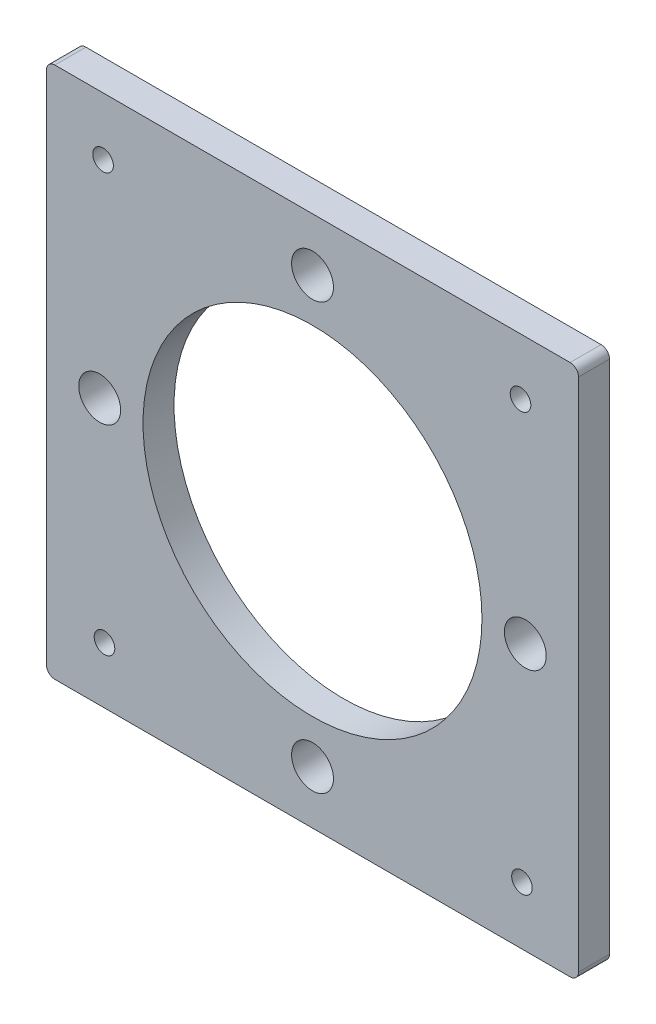
ISO-10303-21;
HEADER;
FILE_DESCRIPTION(('STEP AP214'),'2;1');
FILE_NAME('part.step','',(''),(''),'','','');
FILE_SCHEMA(('AUTOMOTIVE_DESIGN { 1 0 10303 214 1 1 1 1 }'));
ENDSEC;
DATA;
#1=APPLICATION_CONTEXT('core data for automotive mechanical design processes');
#2=APPLICATION_PROTOCOL_DEFINITION('international standard','automotive_design',2000,#1);
#3=PRODUCT_CONTEXT('',#1,'mechanical');
#4=PRODUCT('Part','Part','',(#3));
#5=PRODUCT_RELATED_PRODUCT_CATEGORY('part','',(#4));
#6=PRODUCT_DEFINITION_FORMATION('','',#4);
#7=PRODUCT_DEFINITION_CONTEXT('part definition',#1,'design');
#8=PRODUCT_DEFINITION('design','',#6,#7);
#9=PRODUCT_DEFINITION_SHAPE('','',#8);
#10=(LENGTH_UNIT() NAMED_UNIT(*) SI_UNIT(.MILLI.,.METRE.));
#11=(NAMED_UNIT(*) PLANE_ANGLE_UNIT() SI_UNIT($,.RADIAN.));
#12=(NAMED_UNIT(*) SI_UNIT($,.STERADIAN.) SOLID_ANGLE_UNIT());
#13=UNCERTAINTY_MEASURE_WITH_UNIT(LENGTH_MEASURE(1.E-05),#10,'distance_accuracy_value','');
#14=(GEOMETRIC_REPRESENTATION_CONTEXT(3) GLOBAL_UNCERTAINTY_ASSIGNED_CONTEXT((#13)) GLOBAL_UNIT_ASSIGNED_CONTEXT((#10,
#11,#12)) REPRESENTATION_CONTEXT('',''));
#15=CARTESIAN_POINT('',(0.,0.,0.));
#16=DIRECTION('',(0.,0.,1.));
#17=DIRECTION('',(1.,0.,0.));
#18=AXIS2_PLACEMENT_3D('',#15,#16,#17);
#19=CARTESIAN_POINT('',(-30.75,-30.75,-1.85));
#20=DIRECTION('',(0.,0.,-1.));
#21=DIRECTION('',(0.,1.,0.));
#22=AXIS2_PLACEMENT_3D('',#19,#20,#21);
#23=CYLINDRICAL_SURFACE('',#22,1.00000000000001);
#24=CARTESIAN_POINT('',(-30.75,-30.75,1.85));
#25=DIRECTION('',(0.,0.,-1.));
#26=DIRECTION('',(0.,1.,0.));
#27=AXIS2_PLACEMENT_3D('',#24,#25,#26);
#28=CIRCLE('',#27,1.00000000000001);
#29=CARTESIAN_POINT('',(-30.75,-31.75,1.85));
#30=VERTEX_POINT('',#29);
#31=CARTESIAN_POINT('',(-31.75,-30.75,1.85));
#32=VERTEX_POINT('',#31);
#33=EDGE_CURVE('E127',#30,#32,#28,.T.);
#34=ORIENTED_EDGE('',*,*,#33,.T.);
#35=DIRECTION('',(0.,0.,1.));
#36=VECTOR('',#35,1.);
#37=CARTESIAN_POINT('',(-31.75,-30.75,-2.035));
#38=LINE('',#37,#36);
#39=CARTESIAN_POINT('',(-31.75,-30.75,-1.85));
#40=VERTEX_POINT('',#39);
#41=EDGE_CURVE('E122',#40,#32,#38,.T.);
#42=ORIENTED_EDGE('',*,*,#41,.F.);
#43=CARTESIAN_POINT('',(-30.75,-30.75,-1.85));
#44=DIRECTION('',(0.,0.,-1.));
#45=DIRECTION('',(0.,1.,0.));
#46=AXIS2_PLACEMENT_3D('',#43,#44,#45);
#47=CIRCLE('',#46,1.00000000000001);
#48=CARTESIAN_POINT('',(-30.75,-31.75,-1.85));
#49=VERTEX_POINT('',#48);
#50=EDGE_CURVE('E20',#40,#49,#47,.F.);
#51=ORIENTED_EDGE('',*,*,#50,.T.);
#52=DIRECTION('',(0.,0.,-1.));
#53=VECTOR('',#52,1.);
#54=CARTESIAN_POINT('',(-30.75,-31.75,2.035));
#55=LINE('',#54,#53);
#56=EDGE_CURVE('E125',#30,#49,#55,.T.);
#57=ORIENTED_EDGE('',*,*,#56,.F.);
#58=EDGE_LOOP('',(#34,#42,#51,#57));
#59=FACE_BOUND('',#58,.T.);
#60=ADVANCED_FACE('F16',(#59),#23,.T.);
#61=CARTESIAN_POINT('',(-33.825,-31.75,2.035));
#62=DIRECTION('',(0.,-1.,0.));
#63=DIRECTION('',(0.,0.,-1.));
#64=AXIS2_PLACEMENT_3D('',#61,#62,#63);
#65=PLANE('',#64);
#66=DIRECTION('',(0.,0.,-1.));
#67=VECTOR('',#66,1.);
#68=CARTESIAN_POINT('',(30.75,-31.75,0.));
#69=LINE('',#68,#67);
#70=CARTESIAN_POINT('',(30.75,-31.75,1.85));
#71=VERTEX_POINT('',#70);
#72=CARTESIAN_POINT('',(30.75,-31.75,-1.85));
#73=VERTEX_POINT('',#72);
#74=EDGE_CURVE('E69',#71,#73,#69,.T.);
#75=ORIENTED_EDGE('',*,*,#74,.F.);
#76=DIRECTION('',(1.,0.,0.));
#77=VECTOR('',#76,1.);
#78=CARTESIAN_POINT('',(-34.925,-31.75,1.85));
#79=LINE('',#78,#77);
#80=EDGE_CURVE('E186',#30,#71,#79,.T.);
#81=ORIENTED_EDGE('',*,*,#80,.F.);
#82=ORIENTED_EDGE('',*,*,#56,.T.);
#83=DIRECTION('',(-1.,0.,0.));
#84=VECTOR('',#83,1.);
#85=CARTESIAN_POINT('',(34.925,-31.75,-1.85));
#86=LINE('',#85,#84);
#87=EDGE_CURVE('E156',#73,#49,#86,.T.);
#88=ORIENTED_EDGE('',*,*,#87,.F.);
#89=EDGE_LOOP('',(#75,#81,#82,#88));
#90=FACE_BOUND('',#89,.T.);
#91=ADVANCED_FACE('F217',(#90),#65,.T.);
#92=CARTESIAN_POINT('',(-31.75,-33.825,-2.035));
#93=DIRECTION('',(-1.,0.,0.));
#94=DIRECTION('',(0.,0.,1.));
#95=AXIS2_PLACEMENT_3D('',#92,#93,#94);
#96=PLANE('',#95);
#97=DIRECTION('',(0.,0.,1.));
#98=VECTOR('',#97,1.);
#99=CARTESIAN_POINT('',(-31.7499999999999,30.75,0.));
#100=LINE('',#99,#98);
#101=CARTESIAN_POINT('',(-31.75,30.75,-1.85));
#102=VERTEX_POINT('',#101);
#103=CARTESIAN_POINT('',(-31.75,30.75,1.85));
#104=VERTEX_POINT('',#103);
#105=EDGE_CURVE('E120',#102,#104,#100,.T.);
#106=ORIENTED_EDGE('',*,*,#105,.F.);
#107=DIRECTION('',(0.,1.,0.));
#108=VECTOR('',#107,1.);
#109=CARTESIAN_POINT('',(-31.75,-34.925,-1.85));
#110=LINE('',#109,#108);
#111=EDGE_CURVE('E101',#40,#102,#110,.T.);
#112=ORIENTED_EDGE('',*,*,#111,.F.);
#113=ORIENTED_EDGE('',*,*,#41,.T.);
#114=DIRECTION('',(0.,1.,0.));
#115=VECTOR('',#114,1.);
#116=CARTESIAN_POINT('',(-31.75,-34.925,1.85));
#117=LINE('',#116,#115);
#118=EDGE_CURVE('E188',#104,#32,#117,.F.);
#119=ORIENTED_EDGE('',*,*,#118,.F.);
#120=EDGE_LOOP('',(#106,#112,#113,#119));
#121=FACE_BOUND('',#120,.T.);
#122=ADVANCED_FACE('F194',(#121),#96,.T.);
#123=CARTESIAN_POINT('',(25.,-24.8271899766452,-1.85000000000001));
#124=DIRECTION('',(0.,0.,1.));
#125=DIRECTION('',(1.,0.,0.));
#126=AXIS2_PLACEMENT_3D('',#123,#124,#125);
#127=CYLINDRICAL_SURFACE('',#126,1.2295);
#128=CARTESIAN_POINT('',(25.,-24.8271899766452,1.85));
#129=DIRECTION('',(0.,0.,1.));
#130=DIRECTION('',(1.,0.,0.));
#131=AXIS2_PLACEMENT_3D('',#128,#129,#130);
#132=CIRCLE('',#131,1.2295);
#133=CARTESIAN_POINT('',(26.2295,-24.8271899766452,1.85));
#134=VERTEX_POINT('',#133);
#135=EDGE_CURVE('E183',#134,#134,#132,.F.);
#136=ORIENTED_EDGE('',*,*,#135,.F.);
#137=EDGE_LOOP('',(#136));
#138=FACE_BOUND('',#137,.T.);
#139=CARTESIAN_POINT('',(25.,-24.8271899766452,-1.85));
#140=DIRECTION('',(0.,0.,1.));
#141=DIRECTION('',(1.,0.,0.));
#142=AXIS2_PLACEMENT_3D('',#139,#140,#141);
#143=CIRCLE('',#142,1.2295);
#144=CARTESIAN_POINT('',(26.2295,-24.8271899766452,-1.85));
#145=VERTEX_POINT('',#144);
#146=EDGE_CURVE('E102',#145,#145,#143,.T.);
#147=ORIENTED_EDGE('',*,*,#146,.F.);
#148=EDGE_LOOP('',(#147));
#149=FACE_BOUND('',#148,.T.);
#150=ADVANCED_FACE('F225',(#138,#149),#127,.F.);
#151=CARTESIAN_POINT('',(-24.8271899766452,-25.,-1.85000000000001));
#152=DIRECTION('',(0.,0.,1.));
#153=DIRECTION('',(1.,0.,0.));
#154=AXIS2_PLACEMENT_3D('',#151,#152,#153);
#155=CYLINDRICAL_SURFACE('',#154,1.2295);
#156=CARTESIAN_POINT('',(-24.8271899766452,-25.,1.85));
#157=DIRECTION('',(0.,0.,1.));
#158=DIRECTION('',(1.,0.,0.));
#159=AXIS2_PLACEMENT_3D('',#156,#157,#158);
#160=CIRCLE('',#159,1.2295);
#161=CARTESIAN_POINT('',(-23.5976899766452,-25.,1.85));
#162=VERTEX_POINT('',#161);
#163=EDGE_CURVE('E180',#162,#162,#160,.F.);
#164=ORIENTED_EDGE('',*,*,#163,.F.);
#165=EDGE_LOOP('',(#164));
#166=FACE_BOUND('',#165,.T.);
#167=CARTESIAN_POINT('',(-24.8271899766452,-25.,-1.85));
#168=DIRECTION('',(0.,0.,1.));
#169=DIRECTION('',(1.,0.,0.));
#170=AXIS2_PLACEMENT_3D('',#167,#168,#169);
#171=CIRCLE('',#170,1.2295);
#172=CARTESIAN_POINT('',(-23.5976899766452,-25.,-1.85));
#173=VERTEX_POINT('',#172);
#174=EDGE_CURVE('E148',#173,#173,#171,.T.);
#175=ORIENTED_EDGE('',*,*,#174,.F.);
#176=EDGE_LOOP('',(#175));
#177=FACE_BOUND('',#176,.T.);
#178=ADVANCED_FACE('F238',(#166,#177),#155,.F.);
#179=CARTESIAN_POINT('',(24.8271899766452,25.,-1.85000000000001));
#180=DIRECTION('',(0.,0.,1.));
#181=DIRECTION('',(1.,0.,0.));
#182=AXIS2_PLACEMENT_3D('',#179,#180,#181);
#183=CYLINDRICAL_SURFACE('',#182,1.2295);
#184=CARTESIAN_POINT('',(24.8271899766452,25.,1.85));
#185=DIRECTION('',(0.,0.,1.));
#186=DIRECTION('',(1.,0.,0.));
#187=AXIS2_PLACEMENT_3D('',#184,#185,#186);
#188=CIRCLE('',#187,1.2295);
#189=CARTESIAN_POINT('',(26.0566899766452,25.,1.85));
#190=VERTEX_POINT('',#189);
#191=EDGE_CURVE('E177',#190,#190,#188,.F.);
#192=ORIENTED_EDGE('',*,*,#191,.F.);
#193=EDGE_LOOP('',(#192));
#194=FACE_BOUND('',#193,.T.);
#195=CARTESIAN_POINT('',(24.8271899766452,25.,-1.85));
#196=DIRECTION('',(0.,0.,1.));
#197=DIRECTION('',(1.,0.,0.));
#198=AXIS2_PLACEMENT_3D('',#195,#196,#197);
#199=CIRCLE('',#198,1.2295);
#200=CARTESIAN_POINT('',(26.0566899766452,25.,-1.85));
#201=VERTEX_POINT('',#200);
#202=EDGE_CURVE('E145',#201,#201,#199,.T.);
#203=ORIENTED_EDGE('',*,*,#202,.F.);
#204=EDGE_LOOP('',(#203));
#205=FACE_BOUND('',#204,.T.);
#206=ADVANCED_FACE('F242',(#194,#205),#183,.F.);
#207=CARTESIAN_POINT('',(-25.,24.8271899766452,-1.85000000000001));
#208=DIRECTION('',(0.,0.,1.));
#209=DIRECTION('',(1.,0.,0.));
#210=AXIS2_PLACEMENT_3D('',#207,#208,#209);
#211=CYLINDRICAL_SURFACE('',#210,1.2295);
#212=CARTESIAN_POINT('',(-25.,24.8271899766452,1.85));
#213=DIRECTION('',(0.,0.,1.));
#214=DIRECTION('',(1.,0.,0.));
#215=AXIS2_PLACEMENT_3D('',#212,#213,#214);
#216=CIRCLE('',#215,1.2295);
#217=CARTESIAN_POINT('',(-23.7705,24.8271899766452,1.85));
#218=VERTEX_POINT('',#217);
#219=EDGE_CURVE('E174',#218,#218,#216,.F.);
#220=ORIENTED_EDGE('',*,*,#219,.F.);
#221=EDGE_LOOP('',(#220));
#222=FACE_BOUND('',#221,.T.);
#223=CARTESIAN_POINT('',(-25.,24.8271899766452,-1.85));
#224=DIRECTION('',(0.,0.,1.));
#225=DIRECTION('',(1.,0.,0.));
#226=AXIS2_PLACEMENT_3D('',#223,#224,#225);
#227=CIRCLE('',#226,1.2295);
#228=CARTESIAN_POINT('',(-23.7705,24.8271899766452,-1.85));
#229=VERTEX_POINT('',#228);
#230=EDGE_CURVE('E142',#229,#229,#227,.T.);
#231=ORIENTED_EDGE('',*,*,#230,.F.);
#232=EDGE_LOOP('',(#231));
#233=FACE_BOUND('',#232,.T.);
#234=ADVANCED_FACE('F246',(#222,#233),#211,.F.);
#235=CARTESIAN_POINT('',(0.,-25.4,-1.85000000000001));
#236=DIRECTION('',(0.,0.,1.));
#237=DIRECTION('',(1.,0.,0.));
#238=AXIS2_PLACEMENT_3D('',#235,#236,#237);
#239=CYLINDRICAL_SURFACE('',#238,2.5);
#240=CARTESIAN_POINT('',(0.,-25.4,1.85));
#241=DIRECTION('',(0.,0.,1.));
#242=DIRECTION('',(1.,0.,0.));
#243=AXIS2_PLACEMENT_3D('',#240,#241,#242);
#244=CIRCLE('',#243,2.5);
#245=CARTESIAN_POINT('',(2.5,-25.4,1.85));
#246=VERTEX_POINT('',#245);
#247=EDGE_CURVE('E171',#246,#246,#244,.F.);
#248=ORIENTED_EDGE('',*,*,#247,.F.);
#249=EDGE_LOOP('',(#248));
#250=FACE_BOUND('',#249,.T.);
#251=CARTESIAN_POINT('',(0.,-25.4,-1.85));
#252=DIRECTION('',(0.,0.,1.));
#253=DIRECTION('',(1.,0.,0.));
#254=AXIS2_PLACEMENT_3D('',#251,#252,#253);
#255=CIRCLE('',#254,2.5);
#256=CARTESIAN_POINT('',(2.5,-25.4,-1.85));
#257=VERTEX_POINT('',#256);
#258=EDGE_CURVE('E139',#257,#257,#255,.T.);
#259=ORIENTED_EDGE('',*,*,#258,.F.);
#260=EDGE_LOOP('',(#259));
#261=FACE_BOUND('',#260,.T.);
#262=ADVANCED_FACE('F250',(#250,#261),#239,.F.);
#263=CARTESIAN_POINT('',(-25.4,0.,-1.85000000000001));
#264=DIRECTION('',(0.,0.,1.));
#265=DIRECTION('',(1.,0.,0.));
#266=AXIS2_PLACEMENT_3D('',#263,#264,#265);
#267=CYLINDRICAL_SURFACE('',#266,2.5);
#268=CARTESIAN_POINT('',(-25.4,0.,1.85));
#269=DIRECTION('',(0.,0.,1.));
#270=DIRECTION('',(1.,0.,0.));
#271=AXIS2_PLACEMENT_3D('',#268,#269,#270);
#272=CIRCLE('',#271,2.5);
#273=CARTESIAN_POINT('',(-22.9,0.,1.85));
#274=VERTEX_POINT('',#273);
#275=EDGE_CURVE('E168',#274,#274,#272,.F.);
#276=ORIENTED_EDGE('',*,*,#275,.F.);
#277=EDGE_LOOP('',(#276));
#278=FACE_BOUND('',#277,.T.);
#279=CARTESIAN_POINT('',(-25.4,0.,-1.85));
#280=DIRECTION('',(0.,0.,1.));
#281=DIRECTION('',(1.,0.,0.));
#282=AXIS2_PLACEMENT_3D('',#279,#280,#281);
#283=CIRCLE('',#282,2.5);
#284=CARTESIAN_POINT('',(-22.9,0.,-1.85));
#285=VERTEX_POINT('',#284);
#286=EDGE_CURVE('E136',#285,#285,#283,.T.);
#287=ORIENTED_EDGE('',*,*,#286,.F.);
#288=EDGE_LOOP('',(#287));
#289=FACE_BOUND('',#288,.T.);
#290=ADVANCED_FACE('F254',(#278,#289),#267,.F.);
#291=CARTESIAN_POINT('',(25.4,0.,-1.85000000000001));
#292=DIRECTION('',(0.,0.,1.));
#293=DIRECTION('',(1.,0.,0.));
#294=AXIS2_PLACEMENT_3D('',#291,#292,#293);
#295=CYLINDRICAL_SURFACE('',#294,2.5);
#296=CARTESIAN_POINT('',(25.4,0.,1.85));
#297=DIRECTION('',(0.,0.,1.));
#298=DIRECTION('',(1.,0.,0.));
#299=AXIS2_PLACEMENT_3D('',#296,#297,#298);
#300=CIRCLE('',#299,2.5);
#301=CARTESIAN_POINT('',(27.9,0.,1.85));
#302=VERTEX_POINT('',#301);
#303=EDGE_CURVE('E165',#302,#302,#300,.F.);
#304=ORIENTED_EDGE('',*,*,#303,.F.);
#305=EDGE_LOOP('',(#304));
#306=FACE_BOUND('',#305,.T.);
#307=CARTESIAN_POINT('',(25.4,0.,-1.85));
#308=DIRECTION('',(0.,0.,1.));
#309=DIRECTION('',(1.,0.,0.));
#310=AXIS2_PLACEMENT_3D('',#307,#308,#309);
#311=CIRCLE('',#310,2.5);
#312=CARTESIAN_POINT('',(27.9,0.,-1.85));
#313=VERTEX_POINT('',#312);
#314=EDGE_CURVE('E133',#313,#313,#311,.T.);
#315=ORIENTED_EDGE('',*,*,#314,.F.);
#316=EDGE_LOOP('',(#315));
#317=FACE_BOUND('',#316,.T.);
#318=ADVANCED_FACE('F258',(#306,#317),#295,.F.);
#319=CARTESIAN_POINT('',(0.,25.4,-1.85000000000001));
#320=DIRECTION('',(0.,0.,1.));
#321=DIRECTION('',(1.,0.,0.));
#322=AXIS2_PLACEMENT_3D('',#319,#320,#321);
#323=CYLINDRICAL_SURFACE('',#322,2.5);
#324=CARTESIAN_POINT('',(0.,25.4,1.85));
#325=DIRECTION('',(0.,0.,1.));
#326=DIRECTION('',(1.,0.,0.));
#327=AXIS2_PLACEMENT_3D('',#324,#325,#326);
#328=CIRCLE('',#327,2.5);
#329=CARTESIAN_POINT('',(2.5,25.4,1.85));
#330=VERTEX_POINT('',#329);
#331=EDGE_CURVE('E162',#330,#330,#328,.F.);
#332=ORIENTED_EDGE('',*,*,#331,.F.);
#333=EDGE_LOOP('',(#332));
#334=FACE_BOUND('',#333,.T.);
#335=CARTESIAN_POINT('',(0.,25.4,-1.85));
#336=DIRECTION('',(0.,0.,1.));
#337=DIRECTION('',(1.,0.,0.));
#338=AXIS2_PLACEMENT_3D('',#335,#336,#337);
#339=CIRCLE('',#338,2.5);
#340=CARTESIAN_POINT('',(2.5,25.4,-1.85));
#341=VERTEX_POINT('',#340);
#342=EDGE_CURVE('E115',#341,#341,#339,.T.);
#343=ORIENTED_EDGE('',*,*,#342,.F.);
#344=EDGE_LOOP('',(#343));
#345=FACE_BOUND('',#344,.T.);
#346=ADVANCED_FACE('F261',(#334,#345),#323,.F.);
#347=CARTESIAN_POINT('',(0.,0.,-1.85000000000001));
#348=DIRECTION('',(0.,0.,1.));
#349=DIRECTION('',(1.,0.,0.));
#350=AXIS2_PLACEMENT_3D('',#347,#348,#349);
#351=CYLINDRICAL_SURFACE('',#350,20.225);
#352=CARTESIAN_POINT('',(0.,0.,1.85));
#353=DIRECTION('',(0.,0.,1.));
#354=DIRECTION('',(1.,0.,0.));
#355=AXIS2_PLACEMENT_3D('',#352,#353,#354);
#356=CIRCLE('',#355,20.225);
#357=CARTESIAN_POINT('',(20.225,0.,1.85));
#358=VERTEX_POINT('',#357);
#359=EDGE_CURVE('E159',#358,#358,#356,.F.);
#360=ORIENTED_EDGE('',*,*,#359,.F.);
#361=EDGE_LOOP('',(#360));
#362=FACE_BOUND('',#361,.T.);
#363=CARTESIAN_POINT('',(0.,0.,-1.85));
#364=DIRECTION('',(0.,0.,1.));
#365=DIRECTION('',(1.,0.,0.));
#366=AXIS2_PLACEMENT_3D('',#363,#364,#365);
#367=CIRCLE('',#366,20.225);
#368=CARTESIAN_POINT('',(20.225,0.,-1.85));
#369=VERTEX_POINT('',#368);
#370=EDGE_CURVE('E112',#369,#369,#367,.T.);
#371=ORIENTED_EDGE('',*,*,#370,.F.);
#372=EDGE_LOOP('',(#371));
#373=FACE_BOUND('',#372,.T.);
#374=ADVANCED_FACE('F18',(#362,#373),#351,.F.);
#375=CARTESIAN_POINT('',(-30.75,30.75,1.85));
#376=DIRECTION('',(0.,0.,1.));
#377=DIRECTION('',(1.,0.,0.));
#378=AXIS2_PLACEMENT_3D('',#375,#376,#377);
#379=CYLINDRICAL_SURFACE('',#378,0.999999999999938);
#380=CARTESIAN_POINT('',(-30.75,30.75,-1.85));
#381=DIRECTION('',(0.,0.,1.));
#382=DIRECTION('',(1.,0.,0.));
#383=AXIS2_PLACEMENT_3D('',#380,#381,#382);
#384=CIRCLE('',#383,0.999999999999938);
#385=CARTESIAN_POINT('',(-30.75,31.75,-1.85));
#386=VERTEX_POINT('',#385);
#387=EDGE_CURVE('E95',#102,#386,#384,.F.);
#388=ORIENTED_EDGE('',*,*,#387,.F.);
#389=ORIENTED_EDGE('',*,*,#105,.T.);
#390=CARTESIAN_POINT('',(-30.75,30.75,1.85));
#391=DIRECTION('',(0.,0.,1.));
#392=DIRECTION('',(1.,0.,0.));
#393=AXIS2_PLACEMENT_3D('',#390,#391,#392);
#394=CIRCLE('',#393,0.999999999999938);
#395=CARTESIAN_POINT('',(-30.75,31.75,1.85));
#396=VERTEX_POINT('',#395);
#397=EDGE_CURVE('E90',#396,#104,#394,.T.);
#398=ORIENTED_EDGE('',*,*,#397,.F.);
#399=DIRECTION('',(0.,0.,1.));
#400=VECTOR('',#399,1.);
#401=CARTESIAN_POINT('',(-30.75,31.75,-2.035));
#402=LINE('',#401,#400);
#403=EDGE_CURVE('E105',#386,#396,#402,.T.);
#404=ORIENTED_EDGE('',*,*,#403,.F.);
#405=EDGE_LOOP('',(#388,#389,#398,#404));
#406=FACE_BOUND('',#405,.T.);
#407=ADVANCED_FACE('F106',(#406),#379,.T.);
#408=CARTESIAN_POINT('',(-34.925,-34.925,1.85));
#409=DIRECTION('',(0.,0.,1.));
#410=DIRECTION('',(1.,0.,0.));
#411=AXIS2_PLACEMENT_3D('',#408,#409,#410);
#412=PLANE('',#411);
#413=ORIENTED_EDGE('',*,*,#359,.T.);
#414=EDGE_LOOP('',(#413));
#415=FACE_BOUND('',#414,.T.);
#416=ORIENTED_EDGE('',*,*,#331,.T.);
#417=EDGE_LOOP('',(#416));
#418=FACE_BOUND('',#417,.T.);
#419=ORIENTED_EDGE('',*,*,#303,.T.);
#420=EDGE_LOOP('',(#419));
#421=FACE_BOUND('',#420,.T.);
#422=ORIENTED_EDGE('',*,*,#275,.T.);
#423=EDGE_LOOP('',(#422));
#424=FACE_BOUND('',#423,.T.);
#425=ORIENTED_EDGE('',*,*,#247,.T.);
#426=EDGE_LOOP('',(#425));
#427=FACE_BOUND('',#426,.T.);
#428=ORIENTED_EDGE('',*,*,#219,.T.);
#429=EDGE_LOOP('',(#428));
#430=FACE_BOUND('',#429,.T.);
#431=ORIENTED_EDGE('',*,*,#191,.T.);
#432=EDGE_LOOP('',(#431));
#433=FACE_BOUND('',#432,.T.);
#434=ORIENTED_EDGE('',*,*,#163,.T.);
#435=EDGE_LOOP('',(#434));
#436=FACE_BOUND('',#435,.T.);
#437=ORIENTED_EDGE('',*,*,#135,.T.);
#438=EDGE_LOOP('',(#437));
#439=FACE_BOUND('',#438,.T.);
#440=CARTESIAN_POINT('',(30.75,-30.75,1.85));
#441=DIRECTION('',(0.,0.,-1.));
#442=DIRECTION('',(0.,1.,0.));
#443=AXIS2_PLACEMENT_3D('',#440,#441,#442);
#444=CIRCLE('',#443,1.00000000000001);
#445=CARTESIAN_POINT('',(31.75,-30.75,1.85));
#446=VERTEX_POINT('',#445);
#447=EDGE_CURVE('E129',#446,#71,#444,.T.);
#448=ORIENTED_EDGE('',*,*,#447,.F.);
#449=DIRECTION('',(0.,1.,0.));
#450=VECTOR('',#449,1.);
#451=CARTESIAN_POINT('',(31.75,-33.825,1.85));
#452=LINE('',#451,#450);
#453=CARTESIAN_POINT('',(31.75,30.75,1.85));
#454=VERTEX_POINT('',#453);
#455=EDGE_CURVE('E205',#454,#446,#452,.F.);
#456=ORIENTED_EDGE('',*,*,#455,.F.);
#457=CARTESIAN_POINT('',(30.75,30.75,1.85));
#458=DIRECTION('',(0.,0.,-1.));
#459=DIRECTION('',(-1.,0.,0.));
#460=AXIS2_PLACEMENT_3D('',#457,#458,#459);
#461=CIRCLE('',#460,0.999999999999938);
#462=CARTESIAN_POINT('',(30.75,31.75,1.85));
#463=VERTEX_POINT('',#462);
#464=EDGE_CURVE('E34',#454,#463,#461,.F.);
#465=ORIENTED_EDGE('',*,*,#464,.T.);
#466=DIRECTION('',(1.,0.,0.));
#467=VECTOR('',#466,1.);
#468=CARTESIAN_POINT('',(-33.825,31.75,1.85));
#469=LINE('',#468,#467);
#470=EDGE_CURVE('E109',#396,#463,#469,.T.);
#471=ORIENTED_EDGE('',*,*,#470,.F.);
#472=ORIENTED_EDGE('',*,*,#397,.T.);
#473=ORIENTED_EDGE('',*,*,#118,.T.);
#474=ORIENTED_EDGE('',*,*,#33,.F.);
#475=ORIENTED_EDGE('',*,*,#80,.T.);
#476=EDGE_LOOP('',(#448,#456,#465,#471,#472,#473,#474,#475));
#477=FACE_BOUND('',#476,.T.);
#478=ADVANCED_FACE('F195',(#415,#418,#421,#424,#427,#430,#433,#436,#439,#477),#412,.T.);
#479=CARTESIAN_POINT('',(30.75,-30.75,-1.85));
#480=DIRECTION('',(0.,0.,-1.));
#481=DIRECTION('',(0.,1.,0.));
#482=AXIS2_PLACEMENT_3D('',#479,#480,#481);
#483=CYLINDRICAL_SURFACE('',#482,1.00000000000001);
#484=ORIENTED_EDGE('',*,*,#447,.T.);
#485=ORIENTED_EDGE('',*,*,#74,.T.);
#486=CARTESIAN_POINT('',(30.75,-30.75,-1.85));
#487=DIRECTION('',(0.,0.,-1.));
#488=DIRECTION('',(0.,1.,0.));
#489=AXIS2_PLACEMENT_3D('',#486,#487,#488);
#490=CIRCLE('',#489,1.00000000000001);
#491=CARTESIAN_POINT('',(31.75,-30.75,-1.85));
#492=VERTEX_POINT('',#491);
#493=EDGE_CURVE('E153',#492,#73,#490,.T.);
#494=ORIENTED_EDGE('',*,*,#493,.F.);
#495=DIRECTION('',(0.,0.,-1.));
#496=VECTOR('',#495,1.);
#497=CARTESIAN_POINT('',(31.75,-30.75,2.035));
#498=LINE('',#497,#496);
#499=EDGE_CURVE('E201',#446,#492,#498,.T.);
#500=ORIENTED_EDGE('',*,*,#499,.F.);
#501=EDGE_LOOP('',(#484,#485,#494,#500));
#502=FACE_BOUND('',#501,.T.);
#503=ADVANCED_FACE('F215',(#502),#483,.T.);
#504=CARTESIAN_POINT('',(34.925,-34.925,-1.85));
#505=DIRECTION('',(0.,0.,-1.));
#506=DIRECTION('',(-1.,0.,0.));
#507=AXIS2_PLACEMENT_3D('',#504,#505,#506);
#508=PLANE('',#507);
#509=ORIENTED_EDGE('',*,*,#370,.T.);
#510=EDGE_LOOP('',(#509));
#511=FACE_BOUND('',#510,.T.);
#512=ORIENTED_EDGE('',*,*,#342,.T.);
#513=EDGE_LOOP('',(#512));
#514=FACE_BOUND('',#513,.T.);
#515=ORIENTED_EDGE('',*,*,#314,.T.);
#516=EDGE_LOOP('',(#515));
#517=FACE_BOUND('',#516,.T.);
#518=ORIENTED_EDGE('',*,*,#286,.T.);
#519=EDGE_LOOP('',(#518));
#520=FACE_BOUND('',#519,.T.);
#521=ORIENTED_EDGE('',*,*,#258,.T.);
#522=EDGE_LOOP('',(#521));
#523=FACE_BOUND('',#522,.T.);
#524=ORIENTED_EDGE('',*,*,#230,.T.);
#525=EDGE_LOOP('',(#524));
#526=FACE_BOUND('',#525,.T.);
#527=ORIENTED_EDGE('',*,*,#202,.T.);
#528=EDGE_LOOP('',(#527));
#529=FACE_BOUND('',#528,.T.);
#530=ORIENTED_EDGE('',*,*,#174,.T.);
#531=EDGE_LOOP('',(#530));
#532=FACE_BOUND('',#531,.T.);
#533=ORIENTED_EDGE('',*,*,#146,.T.);
#534=EDGE_LOOP('',(#533));
#535=FACE_BOUND('',#534,.T.);
#536=ORIENTED_EDGE('',*,*,#387,.T.);
#537=DIRECTION('',(1.,0.,0.));
#538=VECTOR('',#537,1.);
#539=CARTESIAN_POINT('',(-33.825,31.75,-1.85));
#540=LINE('',#539,#538);
#541=CARTESIAN_POINT('',(30.75,31.75,-1.85));
#542=VERTEX_POINT('',#541);
#543=EDGE_CURVE('E98',#542,#386,#540,.F.);
#544=ORIENTED_EDGE('',*,*,#543,.F.);
#545=CARTESIAN_POINT('',(30.75,30.75,-1.85));
#546=DIRECTION('',(0.,0.,-1.));
#547=DIRECTION('',(-1.,0.,0.));
#548=AXIS2_PLACEMENT_3D('',#545,#546,#547);
#549=CIRCLE('',#548,0.999999999999938);
#550=CARTESIAN_POINT('',(31.75,30.75,-1.85));
#551=VERTEX_POINT('',#550);
#552=EDGE_CURVE('E128',#542,#551,#549,.T.);
#553=ORIENTED_EDGE('',*,*,#552,.T.);
#554=DIRECTION('',(0.,1.,0.));
#555=VECTOR('',#554,1.);
#556=CARTESIAN_POINT('',(31.75,-33.825,-1.85));
#557=LINE('',#556,#555);
#558=EDGE_CURVE('E204',#492,#551,#557,.T.);
#559=ORIENTED_EDGE('',*,*,#558,.F.);
#560=ORIENTED_EDGE('',*,*,#493,.T.);
#561=ORIENTED_EDGE('',*,*,#87,.T.);
#562=ORIENTED_EDGE('',*,*,#50,.F.);
#563=ORIENTED_EDGE('',*,*,#111,.T.);
#564=EDGE_LOOP('',(#536,#544,#553,#559,#560,#561,#562,#563));
#565=FACE_BOUND('',#564,.T.);
#566=ADVANCED_FACE('F96',(#511,#514,#517,#520,#523,#526,#529,#532,#535,#565),#508,.T.);
#567=CARTESIAN_POINT('',(-33.825,31.75,-2.035));
#568=DIRECTION('',(0.,1.,0.));
#569=DIRECTION('',(0.,0.,1.));
#570=AXIS2_PLACEMENT_3D('',#567,#568,#569);
#571=PLANE('',#570);
#572=ORIENTED_EDGE('',*,*,#403,.T.);
#573=ORIENTED_EDGE('',*,*,#470,.T.);
#574=DIRECTION('',(0.,0.,1.));
#575=VECTOR('',#574,1.);
#576=CARTESIAN_POINT('',(30.75,31.7499999999999,0.));
#577=LINE('',#576,#575);
#578=EDGE_CURVE('E26',#542,#463,#577,.T.);
#579=ORIENTED_EDGE('',*,*,#578,.F.);
#580=ORIENTED_EDGE('',*,*,#543,.T.);
#581=EDGE_LOOP('',(#572,#573,#579,#580));
#582=FACE_BOUND('',#581,.T.);
#583=ADVANCED_FACE('F111',(#582),#571,.T.);
#584=CARTESIAN_POINT('',(31.75,-33.825,2.035));
#585=DIRECTION('',(1.,0.,0.));
#586=DIRECTION('',(0.,0.,-1.));
#587=AXIS2_PLACEMENT_3D('',#584,#585,#586);
#588=PLANE('',#587);
#589=ORIENTED_EDGE('',*,*,#499,.T.);
#590=ORIENTED_EDGE('',*,*,#558,.T.);
#591=DIRECTION('',(0.,0.,-1.));
#592=VECTOR('',#591,1.);
#593=CARTESIAN_POINT('',(31.7499999999999,30.75,0.));
#594=LINE('',#593,#592);
#595=EDGE_CURVE('E10',#454,#551,#594,.T.);
#596=ORIENTED_EDGE('',*,*,#595,.F.);
#597=ORIENTED_EDGE('',*,*,#455,.T.);
#598=EDGE_LOOP('',(#589,#590,#596,#597));
#599=FACE_BOUND('',#598,.T.);
#600=ADVANCED_FACE('F213',(#599),#588,.T.);
#601=CARTESIAN_POINT('',(30.75,30.75,-1.85));
#602=DIRECTION('',(0.,0.,-1.));
#603=DIRECTION('',(-1.,0.,0.));
#604=AXIS2_PLACEMENT_3D('',#601,#602,#603);
#605=CYLINDRICAL_SURFACE('',#604,0.999999999999938);
#606=ORIENTED_EDGE('',*,*,#464,.F.);
#607=ORIENTED_EDGE('',*,*,#595,.T.);
#608=ORIENTED_EDGE('',*,*,#552,.F.);
#609=ORIENTED_EDGE('',*,*,#578,.T.);
#610=EDGE_LOOP('',(#606,#607,#608,#609));
#611=FACE_BOUND('',#610,.T.);
#612=ADVANCED_FACE('F209',(#611),#605,.T.);
#613=CLOSED_SHELL('',(#60,#91,#122,#150,#178,#206,#234,#262,#290,#318,#346,#374,#407,#478,#503,
#566,#583,#600,#612));
#614=MANIFOLD_SOLID_BREP('B1',#613);
#615=ADVANCED_BREP_SHAPE_REPRESENTATION('',(#18,#614),#14);
#616=SHAPE_DEFINITION_REPRESENTATION(#9,#615);
ENDSEC;
END-ISO-10303-21;
